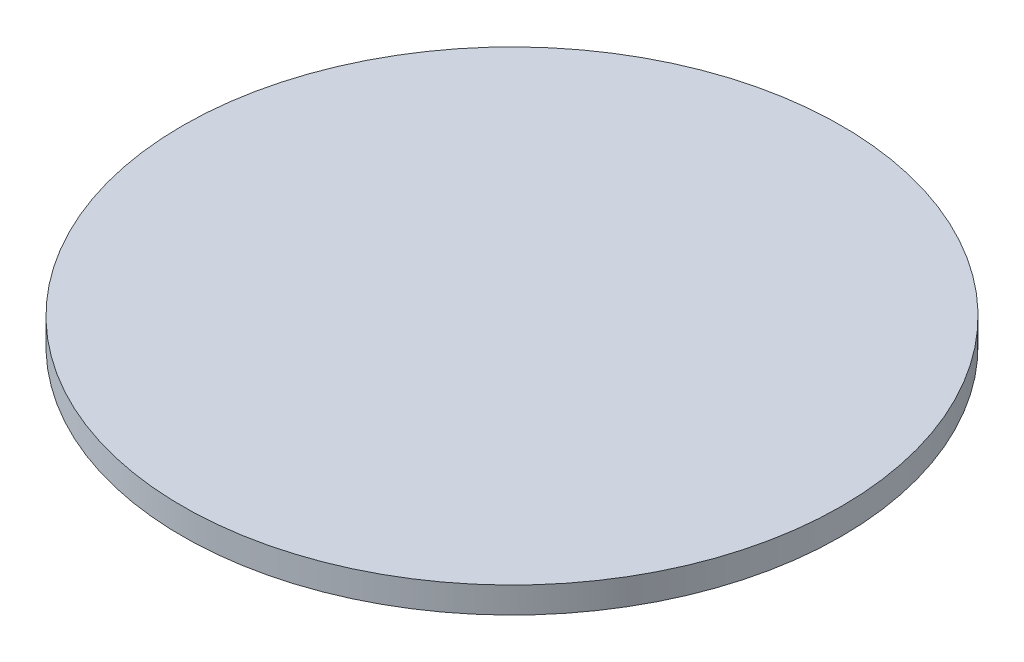
ISO-10303-21;
HEADER;
FILE_DESCRIPTION(('STEP AP214'),'2;1');
FILE_NAME('part.step','',(''),(''),'','','');
FILE_SCHEMA(('AUTOMOTIVE_DESIGN { 1 0 10303 214 1 1 1 1 }'));
ENDSEC;
DATA;
#1=APPLICATION_CONTEXT('core data for automotive mechanical design processes');
#2=APPLICATION_PROTOCOL_DEFINITION('international standard','automotive_design',2000,#1);
#3=PRODUCT_CONTEXT('',#1,'mechanical');
#4=PRODUCT('Part','Part','',(#3));
#5=PRODUCT_RELATED_PRODUCT_CATEGORY('part','',(#4));
#6=PRODUCT_DEFINITION_FORMATION('','',#4);
#7=PRODUCT_DEFINITION_CONTEXT('part definition',#1,'design');
#8=PRODUCT_DEFINITION('design','',#6,#7);
#9=PRODUCT_DEFINITION_SHAPE('','',#8);
#10=(LENGTH_UNIT() NAMED_UNIT(*) SI_UNIT(.MILLI.,.METRE.));
#11=(NAMED_UNIT(*) PLANE_ANGLE_UNIT() SI_UNIT($,.RADIAN.));
#12=(NAMED_UNIT(*) SI_UNIT($,.STERADIAN.) SOLID_ANGLE_UNIT());
#13=UNCERTAINTY_MEASURE_WITH_UNIT(LENGTH_MEASURE(1.E-05),#10,'distance_accuracy_value','');
#14=(GEOMETRIC_REPRESENTATION_CONTEXT(3) GLOBAL_UNCERTAINTY_ASSIGNED_CONTEXT((#13)) GLOBAL_UNIT_ASSIGNED_CONTEXT((#10,
#11,#12)) REPRESENTATION_CONTEXT('',''));
#15=CARTESIAN_POINT('',(0.,0.,0.));
#16=DIRECTION('',(0.,0.,1.));
#17=DIRECTION('',(1.,0.,0.));
#18=AXIS2_PLACEMENT_3D('',#15,#16,#17);
#19=CARTESIAN_POINT('',(38.,0.,0.));
#20=DIRECTION('',(0.,-1.,0.));
#21=DIRECTION('',(1.,0.,0.));
#22=AXIS2_PLACEMENT_3D('',#19,#20,#21);
#23=PLANE('',#22);
#24=CARTESIAN_POINT('',(0.,0.,0.));
#25=DIRECTION('',(0.,1.,0.));
#26=DIRECTION('',(-1.,0.,0.));
#27=AXIS2_PLACEMENT_3D('',#24,#25,#26);
#28=CIRCLE('',#27,38.);
#29=CARTESIAN_POINT('',(-38.,0.,0.));
#30=VERTEX_POINT('',#29);
#31=EDGE_CURVE('E40',#30,#30,#28,.T.);
#32=ORIENTED_EDGE('',*,*,#31,.T.);
#33=EDGE_LOOP('',(#32));
#34=FACE_BOUND('',#33,.T.);
#35=ADVANCED_FACE('F30',(#34),#23,.F.);
#36=CARTESIAN_POINT('',(0.,-4.,0.));
#37=DIRECTION('',(0.,1.,0.));
#38=DIRECTION('',(-1.,0.,0.));
#39=AXIS2_PLACEMENT_3D('',#36,#37,#38);
#40=PLANE('',#39);
#41=CARTESIAN_POINT('',(0.,-4.,0.));
#42=DIRECTION('',(0.,1.,0.));
#43=DIRECTION('',(-1.,0.,0.));
#44=AXIS2_PLACEMENT_3D('',#41,#42,#43);
#45=CIRCLE('',#44,30.);
#46=CARTESIAN_POINT('',(-30.,-4.00000000000001,0.));
#47=VERTEX_POINT('',#46);
#48=EDGE_CURVE('E10',#47,#47,#45,.T.);
#49=ORIENTED_EDGE('',*,*,#48,.F.);
#50=EDGE_LOOP('',(#49));
#51=FACE_BOUND('',#50,.T.);
#52=ADVANCED_FACE('F55',(#51),#40,.F.);
#53=CARTESIAN_POINT('',(0.,28.5,0.));
#54=DIRECTION('',(0.,1.,0.));
#55=DIRECTION('',(-1.,0.,0.));
#56=AXIS2_PLACEMENT_3D('',#53,#54,#55);
#57=DEGENERATE_TOROIDAL_SURFACE('',#56,30.,32.5,.T.);
#58=CARTESIAN_POINT('',(0.,-3.00000000000001,0.));
#59=DIRECTION('',(0.,1.,0.));
#60=DIRECTION('',(-1.,0.,0.));
#61=AXIS2_PLACEMENT_3D('',#58,#59,#60);
#62=CIRCLE('',#61,38.);
#63=CARTESIAN_POINT('',(-38.,-3.00000000000002,0.));
#64=VERTEX_POINT('',#63);
#65=EDGE_CURVE('E36',#64,#64,#62,.T.);
#66=ORIENTED_EDGE('',*,*,#65,.F.);
#67=EDGE_LOOP('',(#66));
#68=FACE_BOUND('',#67,.T.);
#69=ORIENTED_EDGE('',*,*,#48,.T.);
#70=EDGE_LOOP('',(#69));
#71=FACE_BOUND('',#70,.T.);
#72=ADVANCED_FACE('F50',(#68,#71),#57,.T.);
#73=CARTESIAN_POINT('',(0.,0.,0.));
#74=DIRECTION('',(0.,1.,0.));
#75=DIRECTION('',(-1.,0.,0.));
#76=AXIS2_PLACEMENT_3D('',#73,#74,#75);
#77=CYLINDRICAL_SURFACE('',#76,38.);
#78=ORIENTED_EDGE('',*,*,#31,.F.);
#79=EDGE_LOOP('',(#78));
#80=FACE_BOUND('',#79,.T.);
#81=ORIENTED_EDGE('',*,*,#65,.T.);
#82=EDGE_LOOP('',(#81));
#83=FACE_BOUND('',#82,.T.);
#84=ADVANCED_FACE('F48',(#80,#83),#77,.T.);
#85=CLOSED_SHELL('',(#35,#52,#72,#84));
#86=MANIFOLD_SOLID_BREP('B2',#85);
#87=ADVANCED_BREP_SHAPE_REPRESENTATION('',(#18,#86),#14);
#88=SHAPE_DEFINITION_REPRESENTATION(#9,#87);
ENDSEC;
END-ISO-10303-21;
